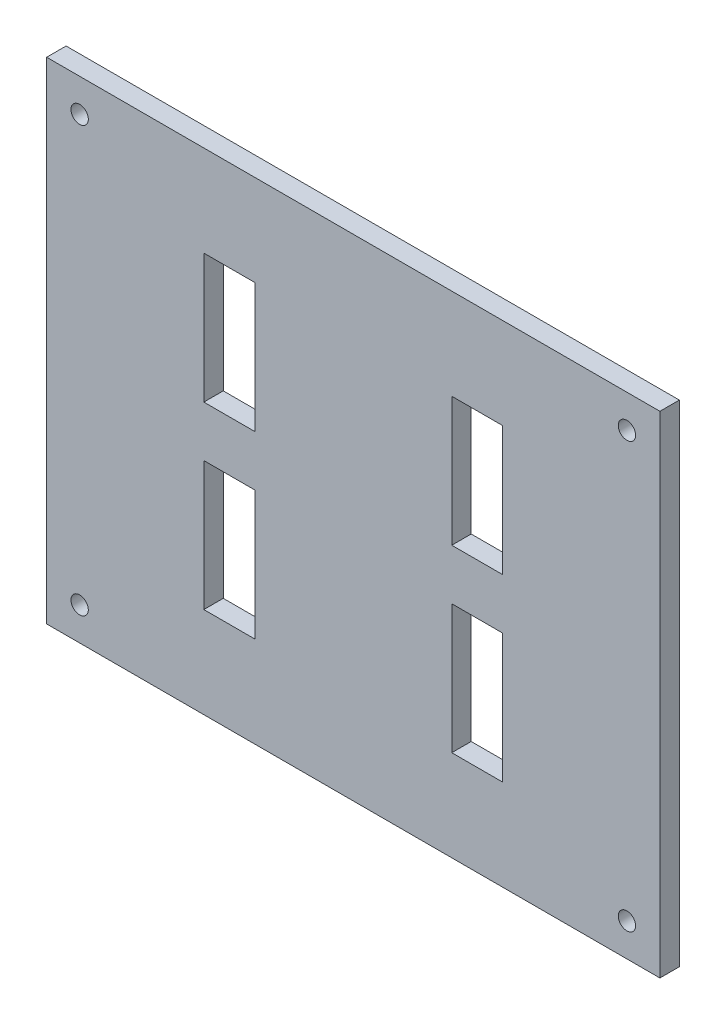
ISO-10303-21;
HEADER;
FILE_DESCRIPTION(('STEP AP214'),'2;1');
FILE_NAME('part.step','',(''),(''),'','','');
FILE_SCHEMA(('AUTOMOTIVE_DESIGN { 1 0 10303 214 1 1 1 1 }'));
ENDSEC;
DATA;
#1=APPLICATION_CONTEXT('core data for automotive mechanical design processes');
#2=APPLICATION_PROTOCOL_DEFINITION('international standard','automotive_design',2000,#1);
#3=PRODUCT_CONTEXT('',#1,'mechanical');
#4=PRODUCT('Part','Part','',(#3));
#5=PRODUCT_RELATED_PRODUCT_CATEGORY('part','',(#4));
#6=PRODUCT_DEFINITION_FORMATION('','',#4);
#7=PRODUCT_DEFINITION_CONTEXT('part definition',#1,'design');
#8=PRODUCT_DEFINITION('design','',#6,#7);
#9=PRODUCT_DEFINITION_SHAPE('','',#8);
#10=(LENGTH_UNIT() NAMED_UNIT(*) SI_UNIT(.MILLI.,.METRE.));
#11=(NAMED_UNIT(*) PLANE_ANGLE_UNIT() SI_UNIT($,.RADIAN.));
#12=(NAMED_UNIT(*) SI_UNIT($,.STERADIAN.) SOLID_ANGLE_UNIT());
#13=UNCERTAINTY_MEASURE_WITH_UNIT(LENGTH_MEASURE(1.E-05),#10,'distance_accuracy_value','');
#14=(GEOMETRIC_REPRESENTATION_CONTEXT(3) GLOBAL_UNCERTAINTY_ASSIGNED_CONTEXT((#13)) GLOBAL_UNIT_ASSIGNED_CONTEXT((#10,
#11,#12)) REPRESENTATION_CONTEXT('',''));
#15=CARTESIAN_POINT('',(0.,0.,0.));
#16=DIRECTION('',(0.,0.,1.));
#17=DIRECTION('',(1.,0.,0.));
#18=AXIS2_PLACEMENT_3D('',#15,#16,#17);
#19=CARTESIAN_POINT('',(0.,0.,3.175));
#20=DIRECTION('',(0.,0.,1.));
#21=DIRECTION('',(1.,0.,0.));
#22=AXIS2_PLACEMENT_3D('',#19,#20,#21);
#23=PLANE('',#22);
#24=CARTESIAN_POINT('',(-44.6966991411009,-34.6966991411009,3.175));
#25=DIRECTION('',(0.,0.,1.));
#26=DIRECTION('',(-1.,0.,0.));
#27=AXIS2_PLACEMENT_3D('',#24,#25,#26);
#28=CIRCLE('',#27,1.415);
#29=CARTESIAN_POINT('',(-46.1116991411009,-34.6966991411009,3.175));
#30=VERTEX_POINT('',#29);
#31=EDGE_CURVE('E263',#30,#30,#28,.T.);
#32=ORIENTED_EDGE('',*,*,#31,.F.);
#33=EDGE_LOOP('',(#32));
#34=FACE_BOUND('',#33,.T.);
#35=CARTESIAN_POINT('',(44.6966991411009,-34.6966991411009,3.175));
#36=DIRECTION('',(0.,0.,1.));
#37=DIRECTION('',(1.,0.,0.));
#38=AXIS2_PLACEMENT_3D('',#35,#36,#37);
#39=CIRCLE('',#38,1.415);
#40=CARTESIAN_POINT('',(46.1116991411009,-34.6966991411009,3.175));
#41=VERTEX_POINT('',#40);
#42=EDGE_CURVE('E274',#41,#41,#39,.T.);
#43=ORIENTED_EDGE('',*,*,#42,.F.);
#44=EDGE_LOOP('',(#43));
#45=FACE_BOUND('',#44,.T.);
#46=CARTESIAN_POINT('',(44.6966991411009,34.6966991411009,3.175));
#47=DIRECTION('',(0.,0.,1.));
#48=DIRECTION('',(-1.,0.,0.));
#49=AXIS2_PLACEMENT_3D('',#46,#47,#48);
#50=CIRCLE('',#49,1.415);
#51=CARTESIAN_POINT('',(43.2816991411009,34.6966991411009,3.175));
#52=VERTEX_POINT('',#51);
#53=EDGE_CURVE('E268',#52,#52,#50,.T.);
#54=ORIENTED_EDGE('',*,*,#53,.F.);
#55=EDGE_LOOP('',(#54));
#56=FACE_BOUND('',#55,.T.);
#57=CARTESIAN_POINT('',(-44.6966991411009,34.6966991411009,3.175));
#58=DIRECTION('',(0.,0.,1.));
#59=DIRECTION('',(1.,0.,0.));
#60=AXIS2_PLACEMENT_3D('',#57,#58,#59);
#61=CIRCLE('',#60,1.415);
#62=CARTESIAN_POINT('',(-43.2816991411009,34.6966991411009,3.175));
#63=VERTEX_POINT('',#62);
#64=EDGE_CURVE('E267',#63,#63,#61,.T.);
#65=ORIENTED_EDGE('',*,*,#64,.F.);
#66=EDGE_LOOP('',(#65));
#67=FACE_BOUND('',#66,.T.);
#68=DIRECTION('',(0.,1.,0.));
#69=VECTOR('',#68,1.);
#70=CARTESIAN_POINT('',(50.085,40.085,3.175));
#71=LINE('',#70,#69);
#72=CARTESIAN_POINT('',(50.085,-40.085,3.175));
#73=VERTEX_POINT('',#72);
#74=CARTESIAN_POINT('',(50.085,40.085,3.175));
#75=VERTEX_POINT('',#74);
#76=EDGE_CURVE('E288',#73,#75,#71,.T.);
#77=ORIENTED_EDGE('',*,*,#76,.T.);
#78=DIRECTION('',(-1.,0.,0.));
#79=VECTOR('',#78,1.);
#80=CARTESIAN_POINT('',(-50.085,40.085,3.175));
#81=LINE('',#80,#79);
#82=CARTESIAN_POINT('',(-50.085,40.085,3.175));
#83=VERTEX_POINT('',#82);
#84=EDGE_CURVE('E291',#75,#83,#81,.T.);
#85=ORIENTED_EDGE('',*,*,#84,.T.);
#86=DIRECTION('',(0.,-1.,0.));
#87=VECTOR('',#86,1.);
#88=CARTESIAN_POINT('',(-50.085,40.085,3.175));
#89=LINE('',#88,#87);
#90=CARTESIAN_POINT('',(-50.085,-40.085,3.175));
#91=VERTEX_POINT('',#90);
#92=EDGE_CURVE('E294',#83,#91,#89,.T.);
#93=ORIENTED_EDGE('',*,*,#92,.T.);
#94=DIRECTION('',(1.,0.,0.));
#95=VECTOR('',#94,1.);
#96=CARTESIAN_POINT('',(-50.085,-40.085,3.175));
#97=LINE('',#96,#95);
#98=EDGE_CURVE('E296',#91,#73,#97,.T.);
#99=ORIENTED_EDGE('',*,*,#98,.T.);
#100=EDGE_LOOP('',(#77,#85,#93,#99));
#101=FACE_BOUND('',#100,.T.);
#102=DIRECTION('',(-1.,0.,0.));
#103=VECTOR('',#102,1.);
#104=CARTESIAN_POINT('',(-16.085,25.215,3.175));
#105=LINE('',#104,#103);
#106=CARTESIAN_POINT('',(-16.085,25.215,3.175));
#107=VERTEX_POINT('',#106);
#108=CARTESIAN_POINT('',(-24.415,25.215,3.175));
#109=VERTEX_POINT('',#108);
#110=EDGE_CURVE('E251',#107,#109,#105,.T.);
#111=ORIENTED_EDGE('',*,*,#110,.F.);
#112=DIRECTION('',(0.,-1.,0.));
#113=VECTOR('',#112,1.);
#114=CARTESIAN_POINT('',(-16.085,25.215,3.175));
#115=LINE('',#114,#113);
#116=CARTESIAN_POINT('',(-16.085,4.13499999999998,3.175));
#117=VERTEX_POINT('',#116);
#118=EDGE_CURVE('E205',#107,#117,#115,.T.);
#119=ORIENTED_EDGE('',*,*,#118,.T.);
#120=DIRECTION('',(-1.,0.,0.));
#121=VECTOR('',#120,1.);
#122=CARTESIAN_POINT('',(-16.085,4.13499999999998,3.175));
#123=LINE('',#122,#121);
#124=CARTESIAN_POINT('',(-24.415,4.13499999999998,3.175));
#125=VERTEX_POINT('',#124);
#126=EDGE_CURVE('E245',#117,#125,#123,.T.);
#127=ORIENTED_EDGE('',*,*,#126,.T.);
#128=DIRECTION('',(0.,-1.,0.));
#129=VECTOR('',#128,1.);
#130=CARTESIAN_POINT('',(-24.415,25.215,3.175));
#131=LINE('',#130,#129);
#132=EDGE_CURVE('E248',#109,#125,#131,.T.);
#133=ORIENTED_EDGE('',*,*,#132,.F.);
#134=EDGE_LOOP('',(#111,#119,#127,#133));
#135=FACE_BOUND('',#134,.T.);
#136=DIRECTION('',(0.,-1.,0.));
#137=VECTOR('',#136,1.);
#138=CARTESIAN_POINT('',(16.085,25.215,3.175));
#139=LINE('',#138,#137);
#140=CARTESIAN_POINT('',(16.085,25.215,3.175));
#141=VERTEX_POINT('',#140);
#142=CARTESIAN_POINT('',(16.085,4.13499999999998,3.175));
#143=VERTEX_POINT('',#142);
#144=EDGE_CURVE('E190',#141,#143,#139,.T.);
#145=ORIENTED_EDGE('',*,*,#144,.F.);
#146=DIRECTION('',(1.,0.,0.));
#147=VECTOR('',#146,1.);
#148=CARTESIAN_POINT('',(16.085,25.215,3.175));
#149=LINE('',#148,#147);
#150=CARTESIAN_POINT('',(24.415,25.215,3.175));
#151=VERTEX_POINT('',#150);
#152=EDGE_CURVE('E200',#141,#151,#149,.T.);
#153=ORIENTED_EDGE('',*,*,#152,.T.);
#154=DIRECTION('',(0.,-1.,0.));
#155=VECTOR('',#154,1.);
#156=CARTESIAN_POINT('',(24.415,25.215,3.175));
#157=LINE('',#156,#155);
#158=CARTESIAN_POINT('',(24.415,4.13499999999998,3.175));
#159=VERTEX_POINT('',#158);
#160=EDGE_CURVE('E198',#151,#159,#157,.T.);
#161=ORIENTED_EDGE('',*,*,#160,.T.);
#162=DIRECTION('',(1.,0.,0.));
#163=VECTOR('',#162,1.);
#164=CARTESIAN_POINT('',(16.085,4.13499999999998,3.175));
#165=LINE('',#164,#163);
#166=EDGE_CURVE('E179',#143,#159,#165,.T.);
#167=ORIENTED_EDGE('',*,*,#166,.F.);
#168=EDGE_LOOP('',(#145,#153,#161,#167));
#169=FACE_BOUND('',#168,.T.);
#170=DIRECTION('',(1.,0.,0.));
#171=VECTOR('',#170,1.);
#172=CARTESIAN_POINT('',(16.085,-25.215,3.175));
#173=LINE('',#172,#171);
#174=CARTESIAN_POINT('',(16.085,-25.215,3.175));
#175=VERTEX_POINT('',#174);
#176=CARTESIAN_POINT('',(24.415,-25.215,3.175));
#177=VERTEX_POINT('',#176);
#178=EDGE_CURVE('E214',#175,#177,#173,.T.);
#179=ORIENTED_EDGE('',*,*,#178,.F.);
#180=DIRECTION('',(0.,1.,0.));
#181=VECTOR('',#180,1.);
#182=CARTESIAN_POINT('',(16.085,-25.215,3.175));
#183=LINE('',#182,#181);
#184=CARTESIAN_POINT('',(16.085,-4.13499999999999,3.175));
#185=VERTEX_POINT('',#184);
#186=EDGE_CURVE('E59',#175,#185,#183,.T.);
#187=ORIENTED_EDGE('',*,*,#186,.T.);
#188=DIRECTION('',(1.,0.,0.));
#189=VECTOR('',#188,1.);
#190=CARTESIAN_POINT('',(16.085,-4.13499999999999,3.175));
#191=LINE('',#190,#189);
#192=CARTESIAN_POINT('',(24.415,-4.13499999999999,3.175));
#193=VERTEX_POINT('',#192);
#194=EDGE_CURVE('E220',#185,#193,#191,.T.);
#195=ORIENTED_EDGE('',*,*,#194,.T.);
#196=DIRECTION('',(0.,1.,0.));
#197=VECTOR('',#196,1.);
#198=CARTESIAN_POINT('',(24.415,-25.215,3.175));
#199=LINE('',#198,#197);
#200=EDGE_CURVE('E217',#177,#193,#199,.T.);
#201=ORIENTED_EDGE('',*,*,#200,.F.);
#202=EDGE_LOOP('',(#179,#187,#195,#201));
#203=FACE_BOUND('',#202,.T.);
#204=DIRECTION('',(0.,1.,0.));
#205=VECTOR('',#204,1.);
#206=CARTESIAN_POINT('',(-16.085,-25.215,3.175));
#207=LINE('',#206,#205);
#208=CARTESIAN_POINT('',(-16.085,-25.215,3.175));
#209=VERTEX_POINT('',#208);
#210=CARTESIAN_POINT('',(-16.085,-4.13499999999999,3.175));
#211=VERTEX_POINT('',#210);
#212=EDGE_CURVE('E233',#209,#211,#207,.T.);
#213=ORIENTED_EDGE('',*,*,#212,.F.);
#214=DIRECTION('',(-1.,0.,0.));
#215=VECTOR('',#214,1.);
#216=CARTESIAN_POINT('',(-16.085,-25.215,3.175));
#217=LINE('',#216,#215);
#218=CARTESIAN_POINT('',(-24.415,-25.215,3.175));
#219=VERTEX_POINT('',#218);
#220=EDGE_CURVE('E51',#209,#219,#217,.T.);
#221=ORIENTED_EDGE('',*,*,#220,.T.);
#222=DIRECTION('',(0.,1.,0.));
#223=VECTOR('',#222,1.);
#224=CARTESIAN_POINT('',(-24.415,-25.215,3.175));
#225=LINE('',#224,#223);
#226=CARTESIAN_POINT('',(-24.415,-4.13499999999999,3.175));
#227=VERTEX_POINT('',#226);
#228=EDGE_CURVE('E239',#219,#227,#225,.T.);
#229=ORIENTED_EDGE('',*,*,#228,.T.);
#230=DIRECTION('',(-1.,0.,0.));
#231=VECTOR('',#230,1.);
#232=CARTESIAN_POINT('',(-16.085,-4.13499999999999,3.175));
#233=LINE('',#232,#231);
#234=EDGE_CURVE('E236',#211,#227,#233,.T.);
#235=ORIENTED_EDGE('',*,*,#234,.F.);
#236=EDGE_LOOP('',(#213,#221,#229,#235));
#237=FACE_BOUND('',#236,.T.);
#238=ADVANCED_FACE('F36',(#34,#45,#56,#67,#101,#135,#169,#203,#237),#23,.T.);
#239=CARTESIAN_POINT('',(0.,0.,0.));
#240=DIRECTION('',(0.,0.,1.));
#241=DIRECTION('',(1.,0.,0.));
#242=AXIS2_PLACEMENT_3D('',#239,#240,#241);
#243=PLANE('',#242);
#244=DIRECTION('',(0.,1.,0.));
#245=VECTOR('',#244,1.);
#246=CARTESIAN_POINT('',(16.085,0.,0.));
#247=LINE('',#246,#245);
#248=CARTESIAN_POINT('',(16.085,-25.215,0.));
#249=VERTEX_POINT('',#248);
#250=CARTESIAN_POINT('',(16.085,-4.13499999999999,0.));
#251=VERTEX_POINT('',#250);
#252=EDGE_CURVE('E342',#249,#251,#247,.T.);
#253=ORIENTED_EDGE('',*,*,#252,.F.);
#254=DIRECTION('',(1.,0.,0.));
#255=VECTOR('',#254,1.);
#256=CARTESIAN_POINT('',(0.,-25.215,0.));
#257=LINE('',#256,#255);
#258=CARTESIAN_POINT('',(24.415,-25.215,0.));
#259=VERTEX_POINT('',#258);
#260=EDGE_CURVE('E334',#249,#259,#257,.T.);
#261=ORIENTED_EDGE('',*,*,#260,.T.);
#262=DIRECTION('',(0.,1.,0.));
#263=VECTOR('',#262,1.);
#264=CARTESIAN_POINT('',(24.415,0.,0.));
#265=LINE('',#264,#263);
#266=CARTESIAN_POINT('',(24.415,-4.13499999999999,0.));
#267=VERTEX_POINT('',#266);
#268=EDGE_CURVE('E337',#259,#267,#265,.T.);
#269=ORIENTED_EDGE('',*,*,#268,.T.);
#270=DIRECTION('',(1.,0.,0.));
#271=VECTOR('',#270,1.);
#272=CARTESIAN_POINT('',(0.,-4.13499999999999,0.));
#273=LINE('',#272,#271);
#274=EDGE_CURVE('E340',#251,#267,#273,.T.);
#275=ORIENTED_EDGE('',*,*,#274,.F.);
#276=EDGE_LOOP('',(#253,#261,#269,#275));
#277=FACE_BOUND('',#276,.T.);
#278=DIRECTION('',(0.,-1.,0.));
#279=VECTOR('',#278,1.);
#280=CARTESIAN_POINT('',(-16.085,0.,0.));
#281=LINE('',#280,#279);
#282=CARTESIAN_POINT('',(-16.085,25.215,0.));
#283=VERTEX_POINT('',#282);
#284=CARTESIAN_POINT('',(-16.085,4.13499999999998,0.));
#285=VERTEX_POINT('',#284);
#286=EDGE_CURVE('E325',#283,#285,#281,.T.);
#287=ORIENTED_EDGE('',*,*,#286,.F.);
#288=DIRECTION('',(-1.,0.,0.));
#289=VECTOR('',#288,1.);
#290=CARTESIAN_POINT('',(0.,25.215,0.));
#291=LINE('',#290,#289);
#292=CARTESIAN_POINT('',(-24.415,25.215,0.));
#293=VERTEX_POINT('',#292);
#294=EDGE_CURVE('E317',#283,#293,#291,.T.);
#295=ORIENTED_EDGE('',*,*,#294,.T.);
#296=DIRECTION('',(0.,-1.,0.));
#297=VECTOR('',#296,1.);
#298=CARTESIAN_POINT('',(-24.415,0.,0.));
#299=LINE('',#298,#297);
#300=CARTESIAN_POINT('',(-24.415,4.13499999999998,0.));
#301=VERTEX_POINT('',#300);
#302=EDGE_CURVE('E320',#293,#301,#299,.T.);
#303=ORIENTED_EDGE('',*,*,#302,.T.);
#304=DIRECTION('',(-1.,0.,0.));
#305=VECTOR('',#304,1.);
#306=CARTESIAN_POINT('',(0.,4.13499999999998,0.));
#307=LINE('',#306,#305);
#308=EDGE_CURVE('E323',#285,#301,#307,.T.);
#309=ORIENTED_EDGE('',*,*,#308,.F.);
#310=EDGE_LOOP('',(#287,#295,#303,#309));
#311=FACE_BOUND('',#310,.T.);
#312=CARTESIAN_POINT('',(-44.6966991411009,-34.6966991411009,0.));
#313=DIRECTION('',(0.,0.,1.));
#314=DIRECTION('',(-1.,0.,0.));
#315=AXIS2_PLACEMENT_3D('',#312,#313,#314);
#316=CIRCLE('',#315,1.415);
#317=CARTESIAN_POINT('',(-46.1116991411009,-34.6966991411009,0.));
#318=VERTEX_POINT('',#317);
#319=EDGE_CURVE('E277',#318,#318,#316,.T.);
#320=ORIENTED_EDGE('',*,*,#319,.T.);
#321=EDGE_LOOP('',(#320));
#322=FACE_BOUND('',#321,.T.);
#323=CARTESIAN_POINT('',(44.6966991411009,-34.6966991411009,0.));
#324=DIRECTION('',(0.,0.,1.));
#325=DIRECTION('',(1.,0.,0.));
#326=AXIS2_PLACEMENT_3D('',#323,#324,#325);
#327=CIRCLE('',#326,1.415);
#328=CARTESIAN_POINT('',(46.1116991411009,-34.6966991411009,0.));
#329=VERTEX_POINT('',#328);
#330=EDGE_CURVE('E271',#329,#329,#327,.T.);
#331=ORIENTED_EDGE('',*,*,#330,.T.);
#332=EDGE_LOOP('',(#331));
#333=FACE_BOUND('',#332,.T.);
#334=CARTESIAN_POINT('',(44.6966991411009,34.6966991411009,0.));
#335=DIRECTION('',(0.,0.,1.));
#336=DIRECTION('',(-1.,0.,0.));
#337=AXIS2_PLACEMENT_3D('',#334,#335,#336);
#338=CIRCLE('',#337,1.415);
#339=CARTESIAN_POINT('',(43.2816991411009,34.6966991411009,0.));
#340=VERTEX_POINT('',#339);
#341=EDGE_CURVE('E264',#340,#340,#338,.T.);
#342=ORIENTED_EDGE('',*,*,#341,.T.);
#343=EDGE_LOOP('',(#342));
#344=FACE_BOUND('',#343,.T.);
#345=CARTESIAN_POINT('',(-44.6966991411009,34.6966991411009,0.));
#346=DIRECTION('',(0.,0.,1.));
#347=DIRECTION('',(1.,0.,0.));
#348=AXIS2_PLACEMENT_3D('',#345,#346,#347);
#349=CIRCLE('',#348,1.415);
#350=CARTESIAN_POINT('',(-43.2816991411009,34.6966991411009,0.));
#351=VERTEX_POINT('',#350);
#352=EDGE_CURVE('E282',#351,#351,#349,.T.);
#353=ORIENTED_EDGE('',*,*,#352,.T.);
#354=EDGE_LOOP('',(#353));
#355=FACE_BOUND('',#354,.T.);
#356=DIRECTION('',(0.,1.,0.));
#357=VECTOR('',#356,1.);
#358=CARTESIAN_POINT('',(50.085,40.085,0.));
#359=LINE('',#358,#357);
#360=CARTESIAN_POINT('',(50.085,-40.085,0.));
#361=VERTEX_POINT('',#360);
#362=CARTESIAN_POINT('',(50.085,40.085,0.));
#363=VERTEX_POINT('',#362);
#364=EDGE_CURVE('E285',#361,#363,#359,.T.);
#365=ORIENTED_EDGE('',*,*,#364,.F.);
#366=DIRECTION('',(1.,0.,0.));
#367=VECTOR('',#366,1.);
#368=CARTESIAN_POINT('',(-50.085,-40.085,0.));
#369=LINE('',#368,#367);
#370=CARTESIAN_POINT('',(-50.085,-40.085,0.));
#371=VERTEX_POINT('',#370);
#372=EDGE_CURVE('E292',#371,#361,#369,.T.);
#373=ORIENTED_EDGE('',*,*,#372,.F.);
#374=DIRECTION('',(0.,-1.,0.));
#375=VECTOR('',#374,1.);
#376=CARTESIAN_POINT('',(-50.085,40.085,0.));
#377=LINE('',#376,#375);
#378=CARTESIAN_POINT('',(-50.085,40.085,0.));
#379=VERTEX_POINT('',#378);
#380=EDGE_CURVE('E303',#379,#371,#377,.T.);
#381=ORIENTED_EDGE('',*,*,#380,.F.);
#382=DIRECTION('',(-1.,0.,0.));
#383=VECTOR('',#382,1.);
#384=CARTESIAN_POINT('',(-50.085,40.085,0.));
#385=LINE('',#384,#383);
#386=EDGE_CURVE('E301',#363,#379,#385,.T.);
#387=ORIENTED_EDGE('',*,*,#386,.F.);
#388=EDGE_LOOP('',(#365,#373,#381,#387));
#389=FACE_BOUND('',#388,.T.);
#390=DIRECTION('',(1.,0.,0.));
#391=VECTOR('',#390,1.);
#392=CARTESIAN_POINT('',(0.,25.215,0.));
#393=LINE('',#392,#391);
#394=CARTESIAN_POINT('',(16.085,25.215,0.));
#395=VERTEX_POINT('',#394);
#396=CARTESIAN_POINT('',(24.415,25.215,0.));
#397=VERTEX_POINT('',#396);
#398=EDGE_CURVE('E332',#395,#397,#393,.T.);
#399=ORIENTED_EDGE('',*,*,#398,.F.);
#400=DIRECTION('',(0.,-1.,0.));
#401=VECTOR('',#400,1.);
#402=CARTESIAN_POINT('',(16.085,0.,0.));
#403=LINE('',#402,#401);
#404=CARTESIAN_POINT('',(16.085,4.13499999999998,0.));
#405=VERTEX_POINT('',#404);
#406=EDGE_CURVE('E327',#395,#405,#403,.T.);
#407=ORIENTED_EDGE('',*,*,#406,.T.);
#408=DIRECTION('',(1.,0.,0.));
#409=VECTOR('',#408,1.);
#410=CARTESIAN_POINT('',(0.,4.13499999999998,0.));
#411=LINE('',#410,#409);
#412=CARTESIAN_POINT('',(24.415,4.13499999999998,0.));
#413=VERTEX_POINT('',#412);
#414=EDGE_CURVE('E182',#405,#413,#411,.T.);
#415=ORIENTED_EDGE('',*,*,#414,.T.);
#416=DIRECTION('',(0.,-1.,0.));
#417=VECTOR('',#416,1.);
#418=CARTESIAN_POINT('',(24.415,0.,0.));
#419=LINE('',#418,#417);
#420=EDGE_CURVE('E330',#397,#413,#419,.T.);
#421=ORIENTED_EDGE('',*,*,#420,.F.);
#422=EDGE_LOOP('',(#399,#407,#415,#421));
#423=FACE_BOUND('',#422,.T.);
#424=DIRECTION('',(-1.,0.,0.));
#425=VECTOR('',#424,1.);
#426=CARTESIAN_POINT('',(0.,-25.215,0.));
#427=LINE('',#426,#425);
#428=CARTESIAN_POINT('',(-16.085,-25.215,0.));
#429=VERTEX_POINT('',#428);
#430=CARTESIAN_POINT('',(-24.415,-25.215,0.));
#431=VERTEX_POINT('',#430);
#432=EDGE_CURVE('E11',#429,#431,#427,.T.);
#433=ORIENTED_EDGE('',*,*,#432,.F.);
#434=DIRECTION('',(0.,1.,0.));
#435=VECTOR('',#434,1.);
#436=CARTESIAN_POINT('',(-16.085,0.,0.));
#437=LINE('',#436,#435);
#438=CARTESIAN_POINT('',(-16.085,-4.13499999999999,0.));
#439=VERTEX_POINT('',#438);
#440=EDGE_CURVE('E344',#429,#439,#437,.T.);
#441=ORIENTED_EDGE('',*,*,#440,.T.);
#442=DIRECTION('',(-1.,0.,0.));
#443=VECTOR('',#442,1.);
#444=CARTESIAN_POINT('',(0.,-4.13499999999999,0.));
#445=LINE('',#444,#443);
#446=CARTESIAN_POINT('',(-24.415,-4.13499999999999,0.));
#447=VERTEX_POINT('',#446);
#448=EDGE_CURVE('E347',#439,#447,#445,.T.);
#449=ORIENTED_EDGE('',*,*,#448,.T.);
#450=DIRECTION('',(0.,1.,0.));
#451=VECTOR('',#450,1.);
#452=CARTESIAN_POINT('',(-24.415,0.,0.));
#453=LINE('',#452,#451);
#454=EDGE_CURVE('E44',#431,#447,#453,.T.);
#455=ORIENTED_EDGE('',*,*,#454,.F.);
#456=EDGE_LOOP('',(#433,#441,#449,#455));
#457=FACE_BOUND('',#456,.T.);
#458=ADVANCED_FACE('F361',(#277,#311,#322,#333,#344,#355,#389,#423,#457),#243,.F.);
#459=CARTESIAN_POINT('',(50.085,40.085,3.175));
#460=DIRECTION('',(-1.,0.,0.));
#461=DIRECTION('',(0.,-1.,0.));
#462=AXIS2_PLACEMENT_3D('',#459,#460,#461);
#463=PLANE('',#462);
#464=ORIENTED_EDGE('',*,*,#364,.T.);
#465=DIRECTION('',(0.,0.,-1.));
#466=VECTOR('',#465,1.);
#467=CARTESIAN_POINT('',(50.085,40.085,3.175));
#468=LINE('',#467,#466);
#469=EDGE_CURVE('E314',#75,#363,#468,.T.);
#470=ORIENTED_EDGE('',*,*,#469,.F.);
#471=ORIENTED_EDGE('',*,*,#76,.F.);
#472=DIRECTION('',(0.,0.,-1.));
#473=VECTOR('',#472,1.);
#474=CARTESIAN_POINT('',(50.085,-40.085,3.175));
#475=LINE('',#474,#473);
#476=EDGE_CURVE('E298',#73,#361,#475,.T.);
#477=ORIENTED_EDGE('',*,*,#476,.T.);
#478=EDGE_LOOP('',(#464,#470,#471,#477));
#479=FACE_BOUND('',#478,.T.);
#480=ADVANCED_FACE('F38',(#479),#463,.F.);
#481=CARTESIAN_POINT('',(-50.085,40.085,3.175));
#482=DIRECTION('',(0.,-1.,0.));
#483=DIRECTION('',(0.,0.,-1.));
#484=AXIS2_PLACEMENT_3D('',#481,#482,#483);
#485=PLANE('',#484);
#486=ORIENTED_EDGE('',*,*,#386,.T.);
#487=DIRECTION('',(0.,0.,-1.));
#488=VECTOR('',#487,1.);
#489=CARTESIAN_POINT('',(-50.085,40.085,3.175));
#490=LINE('',#489,#488);
#491=EDGE_CURVE('E311',#83,#379,#490,.T.);
#492=ORIENTED_EDGE('',*,*,#491,.F.);
#493=ORIENTED_EDGE('',*,*,#84,.F.);
#494=ORIENTED_EDGE('',*,*,#469,.T.);
#495=EDGE_LOOP('',(#486,#492,#493,#494));
#496=FACE_BOUND('',#495,.T.);
#497=ADVANCED_FACE('F387',(#496),#485,.F.);
#498=CARTESIAN_POINT('',(-50.085,40.085,3.175));
#499=DIRECTION('',(1.,0.,0.));
#500=DIRECTION('',(0.,1.,0.));
#501=AXIS2_PLACEMENT_3D('',#498,#499,#500);
#502=PLANE('',#501);
#503=ORIENTED_EDGE('',*,*,#380,.T.);
#504=DIRECTION('',(0.,0.,-1.));
#505=VECTOR('',#504,1.);
#506=CARTESIAN_POINT('',(-50.085,-40.085,3.175));
#507=LINE('',#506,#505);
#508=EDGE_CURVE('E308',#91,#371,#507,.T.);
#509=ORIENTED_EDGE('',*,*,#508,.F.);
#510=ORIENTED_EDGE('',*,*,#92,.F.);
#511=ORIENTED_EDGE('',*,*,#491,.T.);
#512=EDGE_LOOP('',(#503,#509,#510,#511));
#513=FACE_BOUND('',#512,.T.);
#514=ADVANCED_FACE('F384',(#513),#502,.F.);
#515=CARTESIAN_POINT('',(-50.085,-40.085,3.175));
#516=DIRECTION('',(0.,1.,0.));
#517=DIRECTION('',(0.,0.,1.));
#518=AXIS2_PLACEMENT_3D('',#515,#516,#517);
#519=PLANE('',#518);
#520=ORIENTED_EDGE('',*,*,#372,.T.);
#521=ORIENTED_EDGE('',*,*,#476,.F.);
#522=ORIENTED_EDGE('',*,*,#98,.F.);
#523=ORIENTED_EDGE('',*,*,#508,.T.);
#524=EDGE_LOOP('',(#520,#521,#522,#523));
#525=FACE_BOUND('',#524,.T.);
#526=ADVANCED_FACE('F381',(#525),#519,.F.);
#527=CARTESIAN_POINT('',(-44.6966991411009,34.6966991411009,0.));
#528=DIRECTION('',(0.,0.,1.));
#529=DIRECTION('',(1.,0.,0.));
#530=AXIS2_PLACEMENT_3D('',#527,#528,#529);
#531=CYLINDRICAL_SURFACE('',#530,1.415);
#532=ORIENTED_EDGE('',*,*,#352,.F.);
#533=EDGE_LOOP('',(#532));
#534=FACE_BOUND('',#533,.T.);
#535=ORIENTED_EDGE('',*,*,#64,.T.);
#536=EDGE_LOOP('',(#535));
#537=FACE_BOUND('',#536,.T.);
#538=ADVANCED_FACE('F378',(#534,#537),#531,.F.);
#539=CARTESIAN_POINT('',(44.6966991411009,34.6966991411009,0.));
#540=DIRECTION('',(0.,0.,1.));
#541=DIRECTION('',(1.,0.,0.));
#542=AXIS2_PLACEMENT_3D('',#539,#540,#541);
#543=CYLINDRICAL_SURFACE('',#542,1.415);
#544=ORIENTED_EDGE('',*,*,#341,.F.);
#545=EDGE_LOOP('',(#544));
#546=FACE_BOUND('',#545,.T.);
#547=ORIENTED_EDGE('',*,*,#53,.T.);
#548=EDGE_LOOP('',(#547));
#549=FACE_BOUND('',#548,.T.);
#550=ADVANCED_FACE('F442',(#546,#549),#543,.F.);
#551=CARTESIAN_POINT('',(44.6966991411009,-34.6966991411009,0.));
#552=DIRECTION('',(0.,0.,1.));
#553=DIRECTION('',(1.,0.,0.));
#554=AXIS2_PLACEMENT_3D('',#551,#552,#553);
#555=CYLINDRICAL_SURFACE('',#554,1.415);
#556=ORIENTED_EDGE('',*,*,#330,.F.);
#557=EDGE_LOOP('',(#556));
#558=FACE_BOUND('',#557,.T.);
#559=ORIENTED_EDGE('',*,*,#42,.T.);
#560=EDGE_LOOP('',(#559));
#561=FACE_BOUND('',#560,.T.);
#562=ADVANCED_FACE('F445',(#558,#561),#555,.F.);
#563=CARTESIAN_POINT('',(-44.6966991411009,-34.6966991411009,0.));
#564=DIRECTION('',(0.,0.,1.));
#565=DIRECTION('',(1.,0.,0.));
#566=AXIS2_PLACEMENT_3D('',#563,#564,#565);
#567=CYLINDRICAL_SURFACE('',#566,1.415);
#568=ORIENTED_EDGE('',*,*,#319,.F.);
#569=EDGE_LOOP('',(#568));
#570=FACE_BOUND('',#569,.T.);
#571=ORIENTED_EDGE('',*,*,#31,.T.);
#572=EDGE_LOOP('',(#571));
#573=FACE_BOUND('',#572,.T.);
#574=ADVANCED_FACE('F441',(#570,#573),#567,.F.);
#575=CARTESIAN_POINT('',(-16.085,25.215,-6.825));
#576=DIRECTION('',(-1.,0.,0.));
#577=DIRECTION('',(0.,0.,1.));
#578=AXIS2_PLACEMENT_3D('',#575,#576,#577);
#579=PLANE('',#578);
#580=ORIENTED_EDGE('',*,*,#286,.T.);
#581=DIRECTION('',(0.,0.,1.));
#582=VECTOR('',#581,1.);
#583=CARTESIAN_POINT('',(-16.085,4.13499999999998,-6.825));
#584=LINE('',#583,#582);
#585=EDGE_CURVE('E261',#285,#117,#584,.T.);
#586=ORIENTED_EDGE('',*,*,#585,.T.);
#587=ORIENTED_EDGE('',*,*,#118,.F.);
#588=DIRECTION('',(0.,0.,1.));
#589=VECTOR('',#588,1.);
#590=CARTESIAN_POINT('',(-16.085,25.215,-6.825));
#591=LINE('',#590,#589);
#592=EDGE_CURVE('E254',#283,#107,#591,.T.);
#593=ORIENTED_EDGE('',*,*,#592,.F.);
#594=EDGE_LOOP('',(#580,#586,#587,#593));
#595=FACE_BOUND('',#594,.T.);
#596=ADVANCED_FACE('F417',(#595),#579,.T.);
#597=CARTESIAN_POINT('',(-16.085,4.13499999999998,-6.825));
#598=DIRECTION('',(0.,1.,0.));
#599=DIRECTION('',(-1.,0.,0.));
#600=AXIS2_PLACEMENT_3D('',#597,#598,#599);
#601=PLANE('',#600);
#602=ORIENTED_EDGE('',*,*,#308,.T.);
#603=DIRECTION('',(0.,0.,1.));
#604=VECTOR('',#603,1.);
#605=CARTESIAN_POINT('',(-24.415,4.13499999999998,-6.825));
#606=LINE('',#605,#604);
#607=EDGE_CURVE('E259',#301,#125,#606,.T.);
#608=ORIENTED_EDGE('',*,*,#607,.T.);
#609=ORIENTED_EDGE('',*,*,#126,.F.);
#610=ORIENTED_EDGE('',*,*,#585,.F.);
#611=EDGE_LOOP('',(#602,#608,#609,#610));
#612=FACE_BOUND('',#611,.T.);
#613=ADVANCED_FACE('F424',(#612),#601,.T.);
#614=CARTESIAN_POINT('',(-24.415,25.215,-6.825));
#615=DIRECTION('',(-1.,0.,0.));
#616=DIRECTION('',(0.,0.,1.));
#617=AXIS2_PLACEMENT_3D('',#614,#615,#616);
#618=PLANE('',#617);
#619=DIRECTION('',(0.,0.,1.));
#620=VECTOR('',#619,1.);
#621=CARTESIAN_POINT('',(-24.415,25.215,-6.825));
#622=LINE('',#621,#620);
#623=EDGE_CURVE('E257',#293,#109,#622,.T.);
#624=ORIENTED_EDGE('',*,*,#623,.T.);
#625=ORIENTED_EDGE('',*,*,#132,.T.);
#626=ORIENTED_EDGE('',*,*,#607,.F.);
#627=ORIENTED_EDGE('',*,*,#302,.F.);
#628=EDGE_LOOP('',(#624,#625,#626,#627));
#629=FACE_BOUND('',#628,.T.);
#630=ADVANCED_FACE('F427',(#629),#618,.F.);
#631=CARTESIAN_POINT('',(-16.085,25.215,-6.825));
#632=DIRECTION('',(0.,1.,0.));
#633=DIRECTION('',(0.,0.,1.));
#634=AXIS2_PLACEMENT_3D('',#631,#632,#633);
#635=PLANE('',#634);
#636=ORIENTED_EDGE('',*,*,#592,.T.);
#637=ORIENTED_EDGE('',*,*,#110,.T.);
#638=ORIENTED_EDGE('',*,*,#623,.F.);
#639=ORIENTED_EDGE('',*,*,#294,.F.);
#640=EDGE_LOOP('',(#636,#637,#638,#639));
#641=FACE_BOUND('',#640,.T.);
#642=ADVANCED_FACE('F412',(#641),#635,.F.);
#643=CARTESIAN_POINT('',(16.085,25.215,-6.825));
#644=DIRECTION('',(0.,-1.,0.));
#645=DIRECTION('',(0.,0.,-1.));
#646=AXIS2_PLACEMENT_3D('',#643,#644,#645);
#647=PLANE('',#646);
#648=ORIENTED_EDGE('',*,*,#398,.T.);
#649=DIRECTION('',(0.,0.,1.));
#650=VECTOR('',#649,1.);
#651=CARTESIAN_POINT('',(24.415,25.215,-6.825));
#652=LINE('',#651,#650);
#653=EDGE_CURVE('E224',#397,#151,#652,.T.);
#654=ORIENTED_EDGE('',*,*,#653,.T.);
#655=ORIENTED_EDGE('',*,*,#152,.F.);
#656=DIRECTION('',(0.,0.,1.));
#657=VECTOR('',#656,1.);
#658=CARTESIAN_POINT('',(16.085,25.215,-6.825));
#659=LINE('',#658,#657);
#660=EDGE_CURVE('E185',#395,#141,#659,.T.);
#661=ORIENTED_EDGE('',*,*,#660,.F.);
#662=EDGE_LOOP('',(#648,#654,#655,#661));
#663=FACE_BOUND('',#662,.T.);
#664=ADVANCED_FACE('F434',(#663),#647,.T.);
#665=CARTESIAN_POINT('',(24.415,25.215,-6.825));
#666=DIRECTION('',(-1.,0.,0.));
#667=DIRECTION('',(0.,0.,1.));
#668=AXIS2_PLACEMENT_3D('',#665,#666,#667);
#669=PLANE('',#668);
#670=ORIENTED_EDGE('',*,*,#420,.T.);
#671=DIRECTION('',(0.,0.,1.));
#672=VECTOR('',#671,1.);
#673=CARTESIAN_POINT('',(24.415,4.13499999999998,-6.825));
#674=LINE('',#673,#672);
#675=EDGE_CURVE('E186',#413,#159,#674,.T.);
#676=ORIENTED_EDGE('',*,*,#675,.T.);
#677=ORIENTED_EDGE('',*,*,#160,.F.);
#678=ORIENTED_EDGE('',*,*,#653,.F.);
#679=EDGE_LOOP('',(#670,#676,#677,#678));
#680=FACE_BOUND('',#679,.T.);
#681=ADVANCED_FACE('F523',(#680),#669,.T.);
#682=CARTESIAN_POINT('',(16.085,4.13499999999998,-6.825));
#683=DIRECTION('',(0.,-1.,0.));
#684=DIRECTION('',(1.,0.,0.));
#685=AXIS2_PLACEMENT_3D('',#682,#683,#684);
#686=PLANE('',#685);
#687=DIRECTION('',(0.,0.,1.));
#688=VECTOR('',#687,1.);
#689=CARTESIAN_POINT('',(16.085,4.13499999999998,-6.825));
#690=LINE('',#689,#688);
#691=EDGE_CURVE('E174',#405,#143,#690,.T.);
#692=ORIENTED_EDGE('',*,*,#691,.T.);
#693=ORIENTED_EDGE('',*,*,#166,.T.);
#694=ORIENTED_EDGE('',*,*,#675,.F.);
#695=ORIENTED_EDGE('',*,*,#414,.F.);
#696=EDGE_LOOP('',(#692,#693,#694,#695));
#697=FACE_BOUND('',#696,.T.);
#698=ADVANCED_FACE('F176',(#697),#686,.F.);
#699=CARTESIAN_POINT('',(16.085,25.215,-6.825));
#700=DIRECTION('',(-1.,0.,0.));
#701=DIRECTION('',(0.,0.,1.));
#702=AXIS2_PLACEMENT_3D('',#699,#700,#701);
#703=PLANE('',#702);
#704=ORIENTED_EDGE('',*,*,#660,.T.);
#705=ORIENTED_EDGE('',*,*,#144,.T.);
#706=ORIENTED_EDGE('',*,*,#691,.F.);
#707=ORIENTED_EDGE('',*,*,#406,.F.);
#708=EDGE_LOOP('',(#704,#705,#706,#707));
#709=FACE_BOUND('',#708,.T.);
#710=ADVANCED_FACE('F191',(#709),#703,.F.);
#711=CARTESIAN_POINT('',(16.085,-25.215,-6.825));
#712=DIRECTION('',(1.,0.,0.));
#713=DIRECTION('',(0.,0.,-1.));
#714=AXIS2_PLACEMENT_3D('',#711,#712,#713);
#715=PLANE('',#714);
#716=ORIENTED_EDGE('',*,*,#252,.T.);
#717=DIRECTION('',(0.,0.,1.));
#718=VECTOR('',#717,1.);
#719=CARTESIAN_POINT('',(16.085,-4.13499999999999,-6.825));
#720=LINE('',#719,#718);
#721=EDGE_CURVE('E206',#251,#185,#720,.T.);
#722=ORIENTED_EDGE('',*,*,#721,.T.);
#723=ORIENTED_EDGE('',*,*,#186,.F.);
#724=DIRECTION('',(0.,0.,1.));
#725=VECTOR('',#724,1.);
#726=CARTESIAN_POINT('',(16.085,-25.215,-6.825));
#727=LINE('',#726,#725);
#728=EDGE_CURVE('E212',#249,#175,#727,.T.);
#729=ORIENTED_EDGE('',*,*,#728,.F.);
#730=EDGE_LOOP('',(#716,#722,#723,#729));
#731=FACE_BOUND('',#730,.T.);
#732=ADVANCED_FACE('F550',(#731),#715,.T.);
#733=CARTESIAN_POINT('',(16.085,-4.13499999999999,-6.825));
#734=DIRECTION('',(0.,-1.,0.));
#735=DIRECTION('',(0.,0.,-1.));
#736=AXIS2_PLACEMENT_3D('',#733,#734,#735);
#737=PLANE('',#736);
#738=ORIENTED_EDGE('',*,*,#274,.T.);
#739=DIRECTION('',(0.,0.,1.));
#740=VECTOR('',#739,1.);
#741=CARTESIAN_POINT('',(24.415,-4.13499999999999,-6.825));
#742=LINE('',#741,#740);
#743=EDGE_CURVE('E208',#267,#193,#742,.T.);
#744=ORIENTED_EDGE('',*,*,#743,.T.);
#745=ORIENTED_EDGE('',*,*,#194,.F.);
#746=ORIENTED_EDGE('',*,*,#721,.F.);
#747=EDGE_LOOP('',(#738,#744,#745,#746));
#748=FACE_BOUND('',#747,.T.);
#749=ADVANCED_FACE('F559',(#748),#737,.T.);
#750=CARTESIAN_POINT('',(24.415,-25.215,-6.825));
#751=DIRECTION('',(1.,0.,0.));
#752=DIRECTION('',(0.,0.,-1.));
#753=AXIS2_PLACEMENT_3D('',#750,#751,#752);
#754=PLANE('',#753);
#755=DIRECTION('',(0.,0.,1.));
#756=VECTOR('',#755,1.);
#757=CARTESIAN_POINT('',(24.415,-25.215,-6.825));
#758=LINE('',#757,#756);
#759=EDGE_CURVE('E210',#259,#177,#758,.T.);
#760=ORIENTED_EDGE('',*,*,#759,.T.);
#761=ORIENTED_EDGE('',*,*,#200,.T.);
#762=ORIENTED_EDGE('',*,*,#743,.F.);
#763=ORIENTED_EDGE('',*,*,#268,.F.);
#764=EDGE_LOOP('',(#760,#761,#762,#763));
#765=FACE_BOUND('',#764,.T.);
#766=ADVANCED_FACE('F568',(#765),#754,.F.);
#767=CARTESIAN_POINT('',(16.085,-25.215,-6.825));
#768=DIRECTION('',(0.,-1.,0.));
#769=DIRECTION('',(0.,0.,-1.));
#770=AXIS2_PLACEMENT_3D('',#767,#768,#769);
#771=PLANE('',#770);
#772=ORIENTED_EDGE('',*,*,#728,.T.);
#773=ORIENTED_EDGE('',*,*,#178,.T.);
#774=ORIENTED_EDGE('',*,*,#759,.F.);
#775=ORIENTED_EDGE('',*,*,#260,.F.);
#776=EDGE_LOOP('',(#772,#773,#774,#775));
#777=FACE_BOUND('',#776,.T.);
#778=ADVANCED_FACE('F578',(#777),#771,.F.);
#779=CARTESIAN_POINT('',(-16.085,-25.215,-6.825));
#780=DIRECTION('',(0.,1.,0.));
#781=DIRECTION('',(0.,0.,1.));
#782=AXIS2_PLACEMENT_3D('',#779,#780,#781);
#783=PLANE('',#782);
#784=ORIENTED_EDGE('',*,*,#432,.T.);
#785=DIRECTION('',(0.,0.,1.));
#786=VECTOR('',#785,1.);
#787=CARTESIAN_POINT('',(-24.415,-25.215,-6.825));
#788=LINE('',#787,#786);
#789=EDGE_CURVE('E225',#431,#219,#788,.T.);
#790=ORIENTED_EDGE('',*,*,#789,.T.);
#791=ORIENTED_EDGE('',*,*,#220,.F.);
#792=DIRECTION('',(0.,0.,1.));
#793=VECTOR('',#792,1.);
#794=CARTESIAN_POINT('',(-16.085,-25.215,-6.825));
#795=LINE('',#794,#793);
#796=EDGE_CURVE('E231',#429,#209,#795,.T.);
#797=ORIENTED_EDGE('',*,*,#796,.F.);
#798=EDGE_LOOP('',(#784,#790,#791,#797));
#799=FACE_BOUND('',#798,.T.);
#800=ADVANCED_FACE('F365',(#799),#783,.T.);
#801=CARTESIAN_POINT('',(-24.415,-25.215,-6.825));
#802=DIRECTION('',(1.,0.,0.));
#803=DIRECTION('',(0.,0.,-1.));
#804=AXIS2_PLACEMENT_3D('',#801,#802,#803);
#805=PLANE('',#804);
#806=ORIENTED_EDGE('',*,*,#454,.T.);
#807=DIRECTION('',(0.,0.,1.));
#808=VECTOR('',#807,1.);
#809=CARTESIAN_POINT('',(-24.415,-4.13499999999999,-6.825));
#810=LINE('',#809,#808);
#811=EDGE_CURVE('E227',#447,#227,#810,.T.);
#812=ORIENTED_EDGE('',*,*,#811,.T.);
#813=ORIENTED_EDGE('',*,*,#228,.F.);
#814=ORIENTED_EDGE('',*,*,#789,.F.);
#815=EDGE_LOOP('',(#806,#812,#813,#814));
#816=FACE_BOUND('',#815,.T.);
#817=ADVANCED_FACE('F353',(#816),#805,.T.);
#818=CARTESIAN_POINT('',(-16.085,-4.13499999999999,-6.825));
#819=DIRECTION('',(0.,1.,0.));
#820=DIRECTION('',(-1.,0.,0.));
#821=AXIS2_PLACEMENT_3D('',#818,#819,#820);
#822=PLANE('',#821);
#823=DIRECTION('',(0.,0.,1.));
#824=VECTOR('',#823,1.);
#825=CARTESIAN_POINT('',(-16.085,-4.13499999999999,-6.825));
#826=LINE('',#825,#824);
#827=EDGE_CURVE('E229',#439,#211,#826,.T.);
#828=ORIENTED_EDGE('',*,*,#827,.T.);
#829=ORIENTED_EDGE('',*,*,#234,.T.);
#830=ORIENTED_EDGE('',*,*,#811,.F.);
#831=ORIENTED_EDGE('',*,*,#448,.F.);
#832=EDGE_LOOP('',(#828,#829,#830,#831));
#833=FACE_BOUND('',#832,.T.);
#834=ADVANCED_FACE('F359',(#833),#822,.F.);
#835=CARTESIAN_POINT('',(-16.085,-25.215,-6.825));
#836=DIRECTION('',(1.,0.,0.));
#837=DIRECTION('',(0.,0.,-1.));
#838=AXIS2_PLACEMENT_3D('',#835,#836,#837);
#839=PLANE('',#838);
#840=ORIENTED_EDGE('',*,*,#796,.T.);
#841=ORIENTED_EDGE('',*,*,#212,.T.);
#842=ORIENTED_EDGE('',*,*,#827,.F.);
#843=ORIENTED_EDGE('',*,*,#440,.F.);
#844=EDGE_LOOP('',(#840,#841,#842,#843));
#845=FACE_BOUND('',#844,.T.);
#846=ADVANCED_FACE('F363',(#845),#839,.F.);
#847=CLOSED_SHELL('',(#238,#458,#480,#497,#514,#526,#538,#550,#562,#574,#596,#613,#630,#642,
#664,#681,#698,#710,#732,#749,#766,#778,#800,#817,#834,#846));
#848=MANIFOLD_SOLID_BREP('B2',#847);
#849=ADVANCED_BREP_SHAPE_REPRESENTATION('',(#18,#848),#14);
#850=SHAPE_DEFINITION_REPRESENTATION(#9,#849);
ENDSEC;
END-ISO-10303-21;
